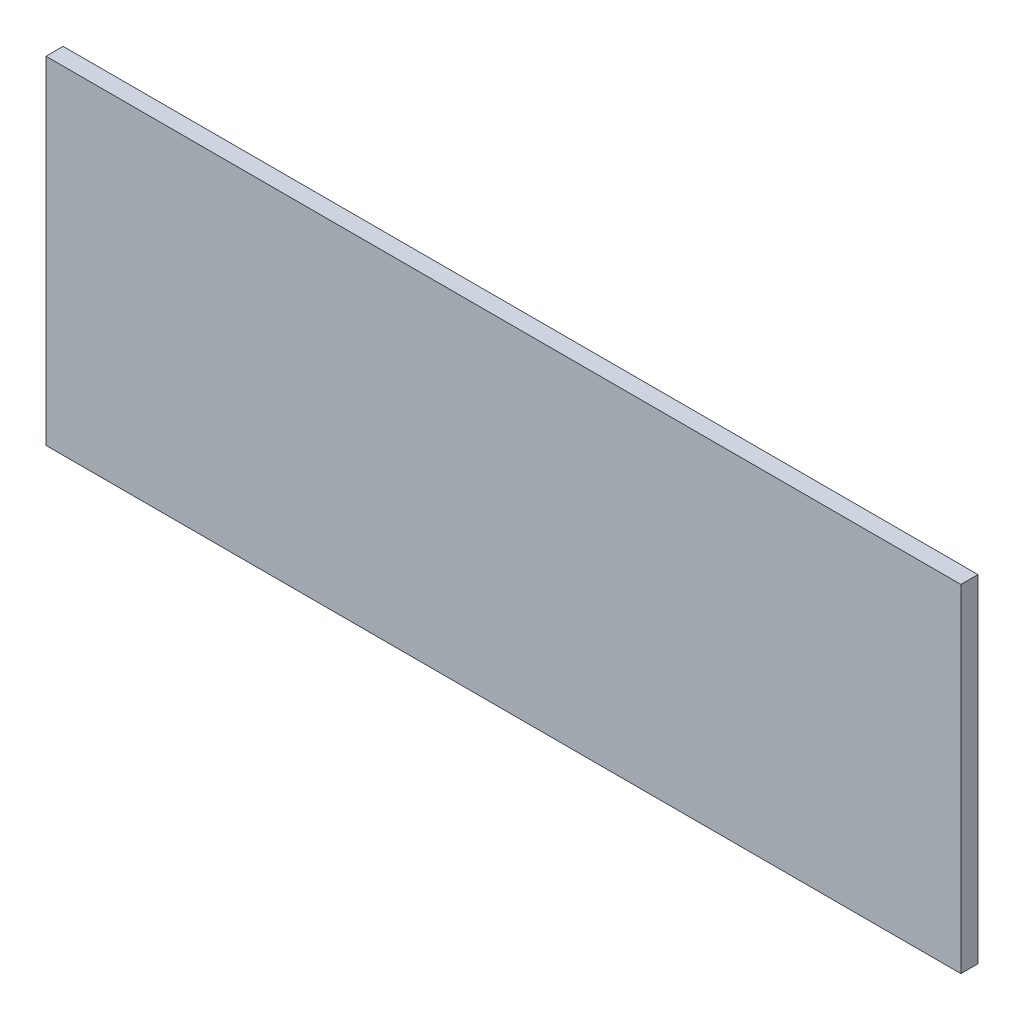
ISO-10303-21;
HEADER;
FILE_DESCRIPTION(('STEP AP214'),'2;1');
FILE_NAME('part.step','',(''),(''),'','','');
FILE_SCHEMA(('AUTOMOTIVE_DESIGN { 1 0 10303 214 1 1 1 1 }'));
ENDSEC;
DATA;
#1=APPLICATION_CONTEXT('core data for automotive mechanical design processes');
#2=APPLICATION_PROTOCOL_DEFINITION('international standard','automotive_design',2000,#1);
#3=PRODUCT_CONTEXT('',#1,'mechanical');
#4=PRODUCT('Part','Part','',(#3));
#5=PRODUCT_RELATED_PRODUCT_CATEGORY('part','',(#4));
#6=PRODUCT_DEFINITION_FORMATION('','',#4);
#7=PRODUCT_DEFINITION_CONTEXT('part definition',#1,'design');
#8=PRODUCT_DEFINITION('design','',#6,#7);
#9=PRODUCT_DEFINITION_SHAPE('','',#8);
#10=(LENGTH_UNIT() NAMED_UNIT(*) SI_UNIT(.MILLI.,.METRE.));
#11=(NAMED_UNIT(*) PLANE_ANGLE_UNIT() SI_UNIT($,.RADIAN.));
#12=(NAMED_UNIT(*) SI_UNIT($,.STERADIAN.) SOLID_ANGLE_UNIT());
#13=UNCERTAINTY_MEASURE_WITH_UNIT(LENGTH_MEASURE(1.E-05),#10,'distance_accuracy_value','');
#14=(GEOMETRIC_REPRESENTATION_CONTEXT(3) GLOBAL_UNCERTAINTY_ASSIGNED_CONTEXT((#13)) GLOBAL_UNIT_ASSIGNED_CONTEXT((#10,
#11,#12)) REPRESENTATION_CONTEXT('',''));
#15=CARTESIAN_POINT('',(0.,0.,0.));
#16=DIRECTION('',(0.,0.,1.));
#17=DIRECTION('',(1.,0.,0.));
#18=AXIS2_PLACEMENT_3D('',#15,#16,#17);
#19=CARTESIAN_POINT('',(81.8669967651367,65.0869979858398,0.));
#20=DIRECTION('',(0.,1.,0.));
#21=DIRECTION('',(1.,0.,0.));
#22=AXIS2_PLACEMENT_3D('',#19,#20,#21);
#23=PLANE('',#22);
#24=DIRECTION('',(1.,0.,0.));
#25=VECTOR('',#24,1.);
#26=CARTESIAN_POINT('',(81.8669967651367,65.0869979858398,0.03556));
#27=LINE('',#26,#25);
#28=CARTESIAN_POINT('',(81.8669967651367,65.0869979858398,0.03556));
#29=VERTEX_POINT('',#28);
#30=CARTESIAN_POINT('',(83.7669982910156,65.0869979858398,0.03556));
#31=VERTEX_POINT('',#30);
#32=EDGE_CURVE('E11',#29,#31,#27,.T.);
#33=ORIENTED_EDGE('',*,*,#32,.F.);
#34=DIRECTION('',(0.,0.,1.));
#35=VECTOR('',#34,1.);
#36=CARTESIAN_POINT('',(81.8669967651367,65.0869979858398,0.));
#37=LINE('',#36,#35);
#38=CARTESIAN_POINT('',(81.8669967651367,65.0869979858398,0.));
#39=VERTEX_POINT('',#38);
#40=EDGE_CURVE('E24',#39,#29,#37,.T.);
#41=ORIENTED_EDGE('',*,*,#40,.F.);
#42=DIRECTION('',(1.,0.,0.));
#43=VECTOR('',#42,1.);
#44=CARTESIAN_POINT('',(81.8669967651367,65.0869979858398,0.));
#45=LINE('',#44,#43);
#46=CARTESIAN_POINT('',(83.7669982910156,65.0869979858398,0.));
#47=VERTEX_POINT('',#46);
#48=EDGE_CURVE('E75',#39,#47,#45,.T.);
#49=ORIENTED_EDGE('',*,*,#48,.T.);
#50=DIRECTION('',(0.,0.,1.));
#51=VECTOR('',#50,1.);
#52=CARTESIAN_POINT('',(83.7669982910156,65.0869979858398,0.));
#53=LINE('',#52,#51);
#54=EDGE_CURVE('E37',#47,#31,#53,.T.);
#55=ORIENTED_EDGE('',*,*,#54,.T.);
#56=EDGE_LOOP('',(#33,#41,#49,#55));
#57=FACE_BOUND('',#56,.T.);
#58=ADVANCED_FACE('F17',(#57),#23,.F.);
#59=CARTESIAN_POINT('',(83.7669982910156,65.0869979858398,0.));
#60=DIRECTION('',(-1.,0.,0.));
#61=DIRECTION('',(0.,1.,0.));
#62=AXIS2_PLACEMENT_3D('',#59,#60,#61);
#63=PLANE('',#62);
#64=DIRECTION('',(0.,1.,0.));
#65=VECTOR('',#64,1.);
#66=CARTESIAN_POINT('',(83.7669982910156,65.0869979858398,0.03556));
#67=LINE('',#66,#65);
#68=CARTESIAN_POINT('',(83.7669982910156,65.7870025634766,0.03556));
#69=VERTEX_POINT('',#68);
#70=EDGE_CURVE('E83',#31,#69,#67,.T.);
#71=ORIENTED_EDGE('',*,*,#70,.F.);
#72=ORIENTED_EDGE('',*,*,#54,.F.);
#73=DIRECTION('',(0.,1.,0.));
#74=VECTOR('',#73,1.);
#75=CARTESIAN_POINT('',(83.7669982910156,65.0869979858398,0.));
#76=LINE('',#75,#74);
#77=CARTESIAN_POINT('',(83.7669982910156,65.7870025634766,0.));
#78=VERTEX_POINT('',#77);
#79=EDGE_CURVE('E81',#47,#78,#76,.T.);
#80=ORIENTED_EDGE('',*,*,#79,.T.);
#81=DIRECTION('',(0.,0.,1.));
#82=VECTOR('',#81,1.);
#83=CARTESIAN_POINT('',(83.7669982910156,65.7870025634766,0.));
#84=LINE('',#83,#82);
#85=EDGE_CURVE('E67',#78,#69,#84,.T.);
#86=ORIENTED_EDGE('',*,*,#85,.T.);
#87=EDGE_LOOP('',(#71,#72,#80,#86));
#88=FACE_BOUND('',#87,.T.);
#89=ADVANCED_FACE('F89',(#88),#63,.F.);
#90=CARTESIAN_POINT('',(83.7669982910156,65.7870025634766,0.));
#91=DIRECTION('',(0.,-1.,0.));
#92=DIRECTION('',(-1.,0.,0.));
#93=AXIS2_PLACEMENT_3D('',#90,#91,#92);
#94=PLANE('',#93);
#95=DIRECTION('',(-1.,0.,0.));
#96=VECTOR('',#95,1.);
#97=CARTESIAN_POINT('',(83.7669982910156,65.7870025634766,0.03556));
#98=LINE('',#97,#96);
#99=CARTESIAN_POINT('',(81.8669967651367,65.7870025634766,0.03556));
#100=VERTEX_POINT('',#99);
#101=EDGE_CURVE('E71',#69,#100,#98,.T.);
#102=ORIENTED_EDGE('',*,*,#101,.F.);
#103=ORIENTED_EDGE('',*,*,#85,.F.);
#104=DIRECTION('',(-1.,0.,0.));
#105=VECTOR('',#104,1.);
#106=CARTESIAN_POINT('',(83.7669982910156,65.7870025634766,0.));
#107=LINE('',#106,#105);
#108=CARTESIAN_POINT('',(81.8669967651367,65.7870025634766,0.));
#109=VERTEX_POINT('',#108);
#110=EDGE_CURVE('E63',#78,#109,#107,.T.);
#111=ORIENTED_EDGE('',*,*,#110,.T.);
#112=DIRECTION('',(0.,0.,1.));
#113=VECTOR('',#112,1.);
#114=CARTESIAN_POINT('',(81.8669967651367,65.7870025634766,0.));
#115=LINE('',#114,#113);
#116=EDGE_CURVE('E53',#109,#100,#115,.T.);
#117=ORIENTED_EDGE('',*,*,#116,.T.);
#118=EDGE_LOOP('',(#102,#103,#111,#117));
#119=FACE_BOUND('',#118,.T.);
#120=ADVANCED_FACE('F66',(#119),#94,.F.);
#121=CARTESIAN_POINT('',(81.8669967651367,65.7870025634766,0.));
#122=DIRECTION('',(1.,0.,0.));
#123=DIRECTION('',(0.,-1.,0.));
#124=AXIS2_PLACEMENT_3D('',#121,#122,#123);
#125=PLANE('',#124);
#126=DIRECTION('',(0.,-1.,0.));
#127=VECTOR('',#126,1.);
#128=CARTESIAN_POINT('',(81.8669967651367,65.7870025634766,0.03556));
#129=LINE('',#128,#127);
#130=EDGE_CURVE('E59',#100,#29,#129,.T.);
#131=ORIENTED_EDGE('',*,*,#130,.F.);
#132=ORIENTED_EDGE('',*,*,#116,.F.);
#133=DIRECTION('',(0.,-1.,0.));
#134=VECTOR('',#133,1.);
#135=CARTESIAN_POINT('',(81.8669967651367,65.7870025634766,0.));
#136=LINE('',#135,#134);
#137=EDGE_CURVE('E57',#109,#39,#136,.T.);
#138=ORIENTED_EDGE('',*,*,#137,.T.);
#139=ORIENTED_EDGE('',*,*,#40,.T.);
#140=EDGE_LOOP('',(#131,#132,#138,#139));
#141=FACE_BOUND('',#140,.T.);
#142=ADVANCED_FACE('F55',(#141),#125,.F.);
#143=CARTESIAN_POINT('',(81.8669967651367,65.0869979858398,0.));
#144=DIRECTION('',(0.,0.,-1.));
#145=DIRECTION('',(-1.,0.,0.));
#146=AXIS2_PLACEMENT_3D('',#143,#144,#145);
#147=PLANE('',#146);
#148=ORIENTED_EDGE('',*,*,#137,.F.);
#149=ORIENTED_EDGE('',*,*,#110,.F.);
#150=ORIENTED_EDGE('',*,*,#79,.F.);
#151=ORIENTED_EDGE('',*,*,#48,.F.);
#152=EDGE_LOOP('',(#148,#149,#150,#151));
#153=FACE_BOUND('',#152,.T.);
#154=ADVANCED_FACE('F74',(#153),#147,.T.);
#155=CARTESIAN_POINT('',(81.8669967651367,65.0869979858398,0.03556));
#156=DIRECTION('',(0.,0.,-1.));
#157=DIRECTION('',(-1.,0.,0.));
#158=AXIS2_PLACEMENT_3D('',#155,#156,#157);
#159=PLANE('',#158);
#160=ORIENTED_EDGE('',*,*,#32,.T.);
#161=ORIENTED_EDGE('',*,*,#70,.T.);
#162=ORIENTED_EDGE('',*,*,#101,.T.);
#163=ORIENTED_EDGE('',*,*,#130,.T.);
#164=EDGE_LOOP('',(#160,#161,#162,#163));
#165=FACE_BOUND('',#164,.T.);
#166=ADVANCED_FACE('F91',(#165),#159,.F.);
#167=CLOSED_SHELL('',(#58,#89,#120,#142,#154,#166));
#168=MANIFOLD_SOLID_BREP('B1',#167);
#169=ADVANCED_BREP_SHAPE_REPRESENTATION('',(#18,#168),#14);
#170=SHAPE_DEFINITION_REPRESENTATION(#9,#169);
ENDSEC;
END-ISO-10303-21;
